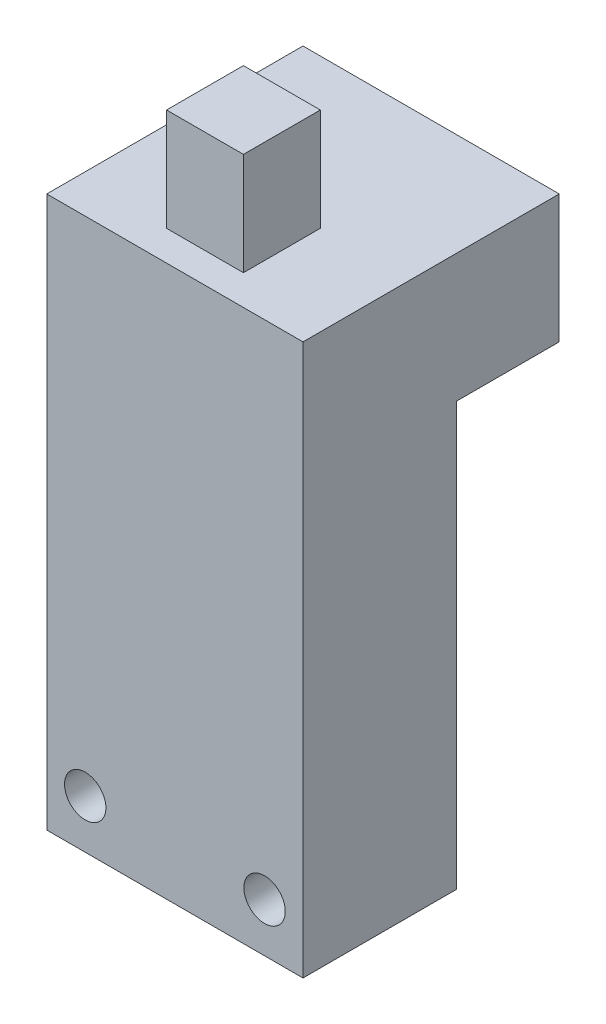
ISO-10303-21;
HEADER;
FILE_DESCRIPTION(('STEP AP214'),'2;1');
FILE_NAME('part.step','',(''),(''),'','','');
FILE_SCHEMA(('AUTOMOTIVE_DESIGN { 1 0 10303 214 1 1 1 1 }'));
ENDSEC;
DATA;
#1=APPLICATION_CONTEXT('core data for automotive mechanical design processes');
#2=APPLICATION_PROTOCOL_DEFINITION('international standard','automotive_design',2000,#1);
#3=PRODUCT_CONTEXT('',#1,'mechanical');
#4=PRODUCT('Part','Part','',(#3));
#5=PRODUCT_RELATED_PRODUCT_CATEGORY('part','',(#4));
#6=PRODUCT_DEFINITION_FORMATION('','',#4);
#7=PRODUCT_DEFINITION_CONTEXT('part definition',#1,'design');
#8=PRODUCT_DEFINITION('design','',#6,#7);
#9=PRODUCT_DEFINITION_SHAPE('','',#8);
#10=(LENGTH_UNIT() NAMED_UNIT(*) SI_UNIT(.MILLI.,.METRE.));
#11=(NAMED_UNIT(*) PLANE_ANGLE_UNIT() SI_UNIT($,.RADIAN.));
#12=(NAMED_UNIT(*) SI_UNIT($,.STERADIAN.) SOLID_ANGLE_UNIT());
#13=UNCERTAINTY_MEASURE_WITH_UNIT(LENGTH_MEASURE(1.E-05),#10,'distance_accuracy_value','');
#14=(GEOMETRIC_REPRESENTATION_CONTEXT(3) GLOBAL_UNCERTAINTY_ASSIGNED_CONTEXT((#13)) GLOBAL_UNIT_ASSIGNED_CONTEXT((#10,
#11,#12)) REPRESENTATION_CONTEXT('',''));
#15=CARTESIAN_POINT('',(0.,0.,0.));
#16=DIRECTION('',(0.,0.,1.));
#17=DIRECTION('',(1.,0.,0.));
#18=AXIS2_PLACEMENT_3D('',#15,#16,#17);
#19=CARTESIAN_POINT('',(0.,10.,0.));
#20=DIRECTION('',(0.,-1.,0.));
#21=DIRECTION('',(0.,0.,-1.));
#22=AXIS2_PLACEMENT_3D('',#19,#20,#21);
#23=PLANE('',#22);
#24=DIRECTION('',(0.,0.,1.));
#25=VECTOR('',#24,1.);
#26=CARTESIAN_POINT('',(0.,10.,0.));
#27=LINE('',#26,#25);
#28=CARTESIAN_POINT('',(0.,10.,-20.));
#29=VERTEX_POINT('',#28);
#30=CARTESIAN_POINT('',(0.,10.,0.));
#31=VERTEX_POINT('',#30);
#32=EDGE_CURVE('E169',#29,#31,#27,.T.);
#33=ORIENTED_EDGE('',*,*,#32,.T.);
#34=DIRECTION('',(1.,0.,0.));
#35=VECTOR('',#34,1.);
#36=CARTESIAN_POINT('',(0.,10.,0.));
#37=LINE('',#36,#35);
#38=CARTESIAN_POINT('',(20.,10.,0.));
#39=VERTEX_POINT('',#38);
#40=EDGE_CURVE('E172',#31,#39,#37,.T.);
#41=ORIENTED_EDGE('',*,*,#40,.T.);
#42=DIRECTION('',(0.,0.,-1.));
#43=VECTOR('',#42,1.);
#44=CARTESIAN_POINT('',(20.,10.,0.));
#45=LINE('',#44,#43);
#46=CARTESIAN_POINT('',(20.,10.,-20.));
#47=VERTEX_POINT('',#46);
#48=EDGE_CURVE('E175',#39,#47,#45,.T.);
#49=ORIENTED_EDGE('',*,*,#48,.T.);
#50=DIRECTION('',(-1.,0.,0.));
#51=VECTOR('',#50,1.);
#52=CARTESIAN_POINT('',(0.,10.,-20.));
#53=LINE('',#52,#51);
#54=EDGE_CURVE('E177',#47,#29,#53,.T.);
#55=ORIENTED_EDGE('',*,*,#54,.T.);
#56=EDGE_LOOP('',(#33,#41,#49,#55));
#57=FACE_BOUND('',#56,.T.);
#58=DIRECTION('',(0.,0.,1.));
#59=VECTOR('',#58,1.);
#60=CARTESIAN_POINT('',(7.,10.,-8.35));
#61=LINE('',#60,#59);
#62=CARTESIAN_POINT('',(7.,10.,-8.35));
#63=VERTEX_POINT('',#62);
#64=CARTESIAN_POINT('',(7.,10.,-2.35));
#65=VERTEX_POINT('',#64);
#66=EDGE_CURVE('E135',#63,#65,#61,.T.);
#67=ORIENTED_EDGE('',*,*,#66,.F.);
#68=DIRECTION('',(-1.,0.,0.));
#69=VECTOR('',#68,1.);
#70=CARTESIAN_POINT('',(7.,10.,-8.35));
#71=LINE('',#70,#69);
#72=CARTESIAN_POINT('',(13.,10.,-8.35));
#73=VERTEX_POINT('',#72);
#74=EDGE_CURVE('E146',#73,#63,#71,.T.);
#75=ORIENTED_EDGE('',*,*,#74,.F.);
#76=DIRECTION('',(0.,0.,-1.));
#77=VECTOR('',#76,1.);
#78=CARTESIAN_POINT('',(13.,10.,-8.35));
#79=LINE('',#78,#77);
#80=CARTESIAN_POINT('',(13.,10.,-2.35));
#81=VERTEX_POINT('',#80);
#82=EDGE_CURVE('E154',#81,#73,#79,.T.);
#83=ORIENTED_EDGE('',*,*,#82,.F.);
#84=DIRECTION('',(1.,0.,0.));
#85=VECTOR('',#84,1.);
#86=CARTESIAN_POINT('',(7.,10.,-2.35));
#87=LINE('',#86,#85);
#88=EDGE_CURVE('E58',#65,#81,#87,.T.);
#89=ORIENTED_EDGE('',*,*,#88,.F.);
#90=EDGE_LOOP('',(#67,#75,#83,#89));
#91=FACE_BOUND('',#90,.T.);
#92=ADVANCED_FACE('F33',(#57,#91),#23,.F.);
#93=CARTESIAN_POINT('',(0.,10.,0.));
#94=DIRECTION('',(1.,0.,0.));
#95=DIRECTION('',(0.,0.,-1.));
#96=AXIS2_PLACEMENT_3D('',#93,#94,#95);
#97=PLANE('',#96);
#98=DIRECTION('',(0.,0.,1.));
#99=VECTOR('',#98,1.);
#100=CARTESIAN_POINT('',(0.,0.,0.));
#101=LINE('',#100,#99);
#102=CARTESIAN_POINT('',(0.,0.,-20.));
#103=VERTEX_POINT('',#102);
#104=CARTESIAN_POINT('',(0.,0.,-12.));
#105=VERTEX_POINT('',#104);
#106=EDGE_CURVE('E134',#103,#105,#101,.T.);
#107=ORIENTED_EDGE('',*,*,#106,.T.);
#108=DIRECTION('',(0.,1.,0.));
#109=VECTOR('',#108,1.);
#110=CARTESIAN_POINT('',(0.,-33.,-12.));
#111=LINE('',#110,#109);
#112=CARTESIAN_POINT('',(0.,-33.,-12.));
#113=VERTEX_POINT('',#112);
#114=EDGE_CURVE('E116',#113,#105,#111,.T.);
#115=ORIENTED_EDGE('',*,*,#114,.F.);
#116=DIRECTION('',(0.,0.,-1.));
#117=VECTOR('',#116,1.);
#118=CARTESIAN_POINT('',(0.,-33.,0.));
#119=LINE('',#118,#117);
#120=CARTESIAN_POINT('',(0.,-33.,0.));
#121=VERTEX_POINT('',#120);
#122=EDGE_CURVE('E123',#121,#113,#119,.T.);
#123=ORIENTED_EDGE('',*,*,#122,.F.);
#124=DIRECTION('',(0.,-1.,0.));
#125=VECTOR('',#124,1.);
#126=CARTESIAN_POINT('',(0.,10.,0.));
#127=LINE('',#126,#125);
#128=EDGE_CURVE('E11',#31,#121,#127,.T.);
#129=ORIENTED_EDGE('',*,*,#128,.F.);
#130=ORIENTED_EDGE('',*,*,#32,.F.);
#131=DIRECTION('',(0.,-1.,0.));
#132=VECTOR('',#131,1.);
#133=CARTESIAN_POINT('',(0.,10.,-20.));
#134=LINE('',#133,#132);
#135=EDGE_CURVE('E179',#29,#103,#134,.T.);
#136=ORIENTED_EDGE('',*,*,#135,.T.);
#137=EDGE_LOOP('',(#107,#115,#123,#129,#130,#136));
#138=FACE_BOUND('',#137,.T.);
#139=ADVANCED_FACE('F35',(#138),#97,.F.);
#140=CARTESIAN_POINT('',(0.,10.,0.));
#141=DIRECTION('',(0.,0.,-1.));
#142=DIRECTION('',(-1.,0.,0.));
#143=AXIS2_PLACEMENT_3D('',#140,#141,#142);
#144=PLANE('',#143);
#145=CARTESIAN_POINT('',(17.,-29.2,0.));
#146=DIRECTION('',(0.,0.,1.));
#147=DIRECTION('',(1.,0.,0.));
#148=AXIS2_PLACEMENT_3D('',#145,#146,#147);
#149=CIRCLE('',#148,1.615);
#150=CARTESIAN_POINT('',(18.615,-29.2,0.));
#151=VERTEX_POINT('',#150);
#152=EDGE_CURVE('E190',#151,#151,#149,.T.);
#153=ORIENTED_EDGE('',*,*,#152,.F.);
#154=EDGE_LOOP('',(#153));
#155=FACE_BOUND('',#154,.T.);
#156=CARTESIAN_POINT('',(3.,-29.2,0.));
#157=DIRECTION('',(0.,0.,1.));
#158=DIRECTION('',(1.,0.,0.));
#159=AXIS2_PLACEMENT_3D('',#156,#157,#158);
#160=CIRCLE('',#159,1.615);
#161=CARTESIAN_POINT('',(4.615,-29.2,0.));
#162=VERTEX_POINT('',#161);
#163=EDGE_CURVE('E195',#162,#162,#160,.T.);
#164=ORIENTED_EDGE('',*,*,#163,.F.);
#165=EDGE_LOOP('',(#164));
#166=FACE_BOUND('',#165,.T.);
#167=ORIENTED_EDGE('',*,*,#128,.T.);
#168=DIRECTION('',(-1.,0.,0.));
#169=VECTOR('',#168,1.);
#170=CARTESIAN_POINT('',(0.,-33.,0.));
#171=LINE('',#170,#169);
#172=CARTESIAN_POINT('',(20.,-33.,0.));
#173=VERTEX_POINT('',#172);
#174=EDGE_CURVE('E129',#173,#121,#171,.T.);
#175=ORIENTED_EDGE('',*,*,#174,.F.);
#176=DIRECTION('',(0.,-1.,0.));
#177=VECTOR('',#176,1.);
#178=CARTESIAN_POINT('',(20.,10.,0.));
#179=LINE('',#178,#177);
#180=EDGE_CURVE('E42',#39,#173,#179,.T.);
#181=ORIENTED_EDGE('',*,*,#180,.F.);
#182=ORIENTED_EDGE('',*,*,#40,.F.);
#183=EDGE_LOOP('',(#167,#175,#181,#182));
#184=FACE_BOUND('',#183,.T.);
#185=ADVANCED_FACE('F209',(#155,#166,#184),#144,.F.);
#186=CARTESIAN_POINT('',(20.,10.,0.));
#187=DIRECTION('',(-1.,0.,0.));
#188=DIRECTION('',(0.,0.,1.));
#189=AXIS2_PLACEMENT_3D('',#186,#187,#188);
#190=PLANE('',#189);
#191=ORIENTED_EDGE('',*,*,#180,.T.);
#192=DIRECTION('',(0.,0.,1.));
#193=VECTOR('',#192,1.);
#194=CARTESIAN_POINT('',(20.,-33.,0.));
#195=LINE('',#194,#193);
#196=CARTESIAN_POINT('',(20.,-33.,-12.));
#197=VERTEX_POINT('',#196);
#198=EDGE_CURVE('E122',#197,#173,#195,.T.);
#199=ORIENTED_EDGE('',*,*,#198,.F.);
#200=DIRECTION('',(0.,1.,0.));
#201=VECTOR('',#200,1.);
#202=CARTESIAN_POINT('',(20.,-33.,-12.));
#203=LINE('',#202,#201);
#204=CARTESIAN_POINT('',(20.,0.,-12.));
#205=VERTEX_POINT('',#204);
#206=EDGE_CURVE('E118',#197,#205,#203,.T.);
#207=ORIENTED_EDGE('',*,*,#206,.T.);
#208=DIRECTION('',(0.,0.,-1.));
#209=VECTOR('',#208,1.);
#210=CARTESIAN_POINT('',(20.,0.,0.));
#211=LINE('',#210,#209);
#212=CARTESIAN_POINT('',(20.,0.,-20.));
#213=VERTEX_POINT('',#212);
#214=EDGE_CURVE('E181',#205,#213,#211,.T.);
#215=ORIENTED_EDGE('',*,*,#214,.T.);
#216=DIRECTION('',(0.,-1.,0.));
#217=VECTOR('',#216,1.);
#218=CARTESIAN_POINT('',(20.,10.,-20.));
#219=LINE('',#218,#217);
#220=EDGE_CURVE('E185',#47,#213,#219,.T.);
#221=ORIENTED_EDGE('',*,*,#220,.F.);
#222=ORIENTED_EDGE('',*,*,#48,.F.);
#223=EDGE_LOOP('',(#191,#199,#207,#215,#221,#222));
#224=FACE_BOUND('',#223,.T.);
#225=ADVANCED_FACE('F204',(#224),#190,.F.);
#226=CARTESIAN_POINT('',(0.,10.,-20.));
#227=DIRECTION('',(0.,0.,1.));
#228=DIRECTION('',(1.,0.,0.));
#229=AXIS2_PLACEMENT_3D('',#226,#227,#228);
#230=PLANE('',#229);
#231=DIRECTION('',(-1.,0.,0.));
#232=VECTOR('',#231,1.);
#233=CARTESIAN_POINT('',(0.,0.,-20.));
#234=LINE('',#233,#232);
#235=EDGE_CURVE('E173',#213,#103,#234,.T.);
#236=ORIENTED_EDGE('',*,*,#235,.T.);
#237=ORIENTED_EDGE('',*,*,#135,.F.);
#238=ORIENTED_EDGE('',*,*,#54,.F.);
#239=ORIENTED_EDGE('',*,*,#220,.T.);
#240=EDGE_LOOP('',(#236,#237,#238,#239));
#241=FACE_BOUND('',#240,.T.);
#242=ADVANCED_FACE('F215',(#241),#230,.F.);
#243=CARTESIAN_POINT('',(0.,0.,0.));
#244=DIRECTION('',(0.,-1.,0.));
#245=DIRECTION('',(0.,0.,-1.));
#246=AXIS2_PLACEMENT_3D('',#243,#244,#245);
#247=PLANE('',#246);
#248=DIRECTION('',(1.,0.,0.));
#249=VECTOR('',#248,1.);
#250=CARTESIAN_POINT('',(0.,0.,-12.));
#251=LINE('',#250,#249);
#252=EDGE_CURVE('E50',#105,#205,#251,.T.);
#253=ORIENTED_EDGE('',*,*,#252,.F.);
#254=ORIENTED_EDGE('',*,*,#106,.F.);
#255=ORIENTED_EDGE('',*,*,#235,.F.);
#256=ORIENTED_EDGE('',*,*,#214,.F.);
#257=EDGE_LOOP('',(#253,#254,#255,#256));
#258=FACE_BOUND('',#257,.T.);
#259=ADVANCED_FACE('F217',(#258),#247,.T.);
#260=CARTESIAN_POINT('',(7.,18.,-8.35));
#261=DIRECTION('',(1.,0.,0.));
#262=DIRECTION('',(0.,0.,-1.));
#263=AXIS2_PLACEMENT_3D('',#260,#261,#262);
#264=PLANE('',#263);
#265=ORIENTED_EDGE('',*,*,#66,.T.);
#266=DIRECTION('',(0.,-1.,0.));
#267=VECTOR('',#266,1.);
#268=CARTESIAN_POINT('',(7.,18.,-2.35));
#269=LINE('',#268,#267);
#270=CARTESIAN_POINT('',(7.,18.,-2.35));
#271=VERTEX_POINT('',#270);
#272=EDGE_CURVE('E167',#271,#65,#269,.T.);
#273=ORIENTED_EDGE('',*,*,#272,.F.);
#274=DIRECTION('',(0.,0.,1.));
#275=VECTOR('',#274,1.);
#276=CARTESIAN_POINT('',(7.,18.,-8.35));
#277=LINE('',#276,#275);
#278=CARTESIAN_POINT('',(7.,18.,-8.35));
#279=VERTEX_POINT('',#278);
#280=EDGE_CURVE('E142',#279,#271,#277,.T.);
#281=ORIENTED_EDGE('',*,*,#280,.F.);
#282=DIRECTION('',(0.,-1.,0.));
#283=VECTOR('',#282,1.);
#284=CARTESIAN_POINT('',(7.,18.,-8.35));
#285=LINE('',#284,#283);
#286=EDGE_CURVE('E151',#279,#63,#285,.T.);
#287=ORIENTED_EDGE('',*,*,#286,.T.);
#288=EDGE_LOOP('',(#265,#273,#281,#287));
#289=FACE_BOUND('',#288,.T.);
#290=ADVANCED_FACE('F219',(#289),#264,.F.);
#291=CARTESIAN_POINT('',(7.,18.,-2.35));
#292=DIRECTION('',(0.,0.,-1.));
#293=DIRECTION('',(-1.,0.,0.));
#294=AXIS2_PLACEMENT_3D('',#291,#292,#293);
#295=PLANE('',#294);
#296=ORIENTED_EDGE('',*,*,#88,.T.);
#297=DIRECTION('',(0.,-1.,0.));
#298=VECTOR('',#297,1.);
#299=CARTESIAN_POINT('',(13.,18.,-2.35));
#300=LINE('',#299,#298);
#301=CARTESIAN_POINT('',(13.,18.,-2.35));
#302=VERTEX_POINT('',#301);
#303=EDGE_CURVE('E164',#302,#81,#300,.T.);
#304=ORIENTED_EDGE('',*,*,#303,.F.);
#305=DIRECTION('',(1.,0.,0.));
#306=VECTOR('',#305,1.);
#307=CARTESIAN_POINT('',(7.,18.,-2.35));
#308=LINE('',#307,#306);
#309=EDGE_CURVE('E145',#271,#302,#308,.T.);
#310=ORIENTED_EDGE('',*,*,#309,.F.);
#311=ORIENTED_EDGE('',*,*,#272,.T.);
#312=EDGE_LOOP('',(#296,#304,#310,#311));
#313=FACE_BOUND('',#312,.T.);
#314=ADVANCED_FACE('F225',(#313),#295,.F.);
#315=CARTESIAN_POINT('',(13.,18.,-8.35));
#316=DIRECTION('',(-1.,0.,0.));
#317=DIRECTION('',(0.,0.,1.));
#318=AXIS2_PLACEMENT_3D('',#315,#316,#317);
#319=PLANE('',#318);
#320=ORIENTED_EDGE('',*,*,#82,.T.);
#321=DIRECTION('',(0.,-1.,0.));
#322=VECTOR('',#321,1.);
#323=CARTESIAN_POINT('',(13.,18.,-8.35));
#324=LINE('',#323,#322);
#325=CARTESIAN_POINT('',(13.,18.,-8.35));
#326=VERTEX_POINT('',#325);
#327=EDGE_CURVE('E161',#326,#73,#324,.T.);
#328=ORIENTED_EDGE('',*,*,#327,.F.);
#329=DIRECTION('',(0.,0.,-1.));
#330=VECTOR('',#329,1.);
#331=CARTESIAN_POINT('',(13.,18.,-8.35));
#332=LINE('',#331,#330);
#333=EDGE_CURVE('E148',#302,#326,#332,.T.);
#334=ORIENTED_EDGE('',*,*,#333,.F.);
#335=ORIENTED_EDGE('',*,*,#303,.T.);
#336=EDGE_LOOP('',(#320,#328,#334,#335));
#337=FACE_BOUND('',#336,.T.);
#338=ADVANCED_FACE('F237',(#337),#319,.F.);
#339=CARTESIAN_POINT('',(7.,18.,-8.35));
#340=DIRECTION('',(0.,0.,1.));
#341=DIRECTION('',(1.,0.,0.));
#342=AXIS2_PLACEMENT_3D('',#339,#340,#341);
#343=PLANE('',#342);
#344=ORIENTED_EDGE('',*,*,#74,.T.);
#345=ORIENTED_EDGE('',*,*,#286,.F.);
#346=DIRECTION('',(-1.,0.,0.));
#347=VECTOR('',#346,1.);
#348=CARTESIAN_POINT('',(7.,18.,-8.35));
#349=LINE('',#348,#347);
#350=EDGE_CURVE('E150',#326,#279,#349,.T.);
#351=ORIENTED_EDGE('',*,*,#350,.F.);
#352=ORIENTED_EDGE('',*,*,#327,.T.);
#353=EDGE_LOOP('',(#344,#345,#351,#352));
#354=FACE_BOUND('',#353,.T.);
#355=ADVANCED_FACE('F241',(#354),#343,.F.);
#356=CARTESIAN_POINT('',(0.,18.,0.));
#357=DIRECTION('',(0.,1.,0.));
#358=DIRECTION('',(0.,0.,1.));
#359=AXIS2_PLACEMENT_3D('',#356,#357,#358);
#360=PLANE('',#359);
#361=ORIENTED_EDGE('',*,*,#280,.T.);
#362=ORIENTED_EDGE('',*,*,#309,.T.);
#363=ORIENTED_EDGE('',*,*,#333,.T.);
#364=ORIENTED_EDGE('',*,*,#350,.T.);
#365=EDGE_LOOP('',(#361,#362,#363,#364));
#366=FACE_BOUND('',#365,.T.);
#367=ADVANCED_FACE('F245',(#366),#360,.T.);
#368=CARTESIAN_POINT('',(0.,-33.,-12.));
#369=DIRECTION('',(0.,0.,1.));
#370=DIRECTION('',(1.,0.,0.));
#371=AXIS2_PLACEMENT_3D('',#368,#369,#370);
#372=PLANE('',#371);
#373=CARTESIAN_POINT('',(17.,-29.2,-12.));
#374=DIRECTION('',(0.,0.,1.));
#375=DIRECTION('',(1.,0.,0.));
#376=AXIS2_PLACEMENT_3D('',#373,#374,#375);
#377=CIRCLE('',#376,1.615);
#378=CARTESIAN_POINT('',(18.615,-29.2,-12.));
#379=VERTEX_POINT('',#378);
#380=EDGE_CURVE('E37',#379,#379,#377,.T.);
#381=ORIENTED_EDGE('',*,*,#380,.T.);
#382=EDGE_LOOP('',(#381));
#383=FACE_BOUND('',#382,.T.);
#384=CARTESIAN_POINT('',(3.,-29.2,-12.));
#385=DIRECTION('',(0.,0.,1.));
#386=DIRECTION('',(1.,0.,0.));
#387=AXIS2_PLACEMENT_3D('',#384,#385,#386);
#388=CIRCLE('',#387,1.615);
#389=CARTESIAN_POINT('',(4.615,-29.2,-12.));
#390=VERTEX_POINT('',#389);
#391=EDGE_CURVE('E188',#390,#390,#388,.T.);
#392=ORIENTED_EDGE('',*,*,#391,.T.);
#393=EDGE_LOOP('',(#392));
#394=FACE_BOUND('',#393,.T.);
#395=ORIENTED_EDGE('',*,*,#252,.T.);
#396=ORIENTED_EDGE('',*,*,#206,.F.);
#397=DIRECTION('',(1.,0.,0.));
#398=VECTOR('',#397,1.);
#399=CARTESIAN_POINT('',(0.,-33.,-12.));
#400=LINE('',#399,#398);
#401=EDGE_CURVE('E112',#113,#197,#400,.T.);
#402=ORIENTED_EDGE('',*,*,#401,.F.);
#403=ORIENTED_EDGE('',*,*,#114,.T.);
#404=EDGE_LOOP('',(#395,#396,#402,#403));
#405=FACE_BOUND('',#404,.T.);
#406=ADVANCED_FACE('F114',(#383,#394,#405),#372,.F.);
#407=CARTESIAN_POINT('',(0.,-33.,0.));
#408=DIRECTION('',(0.,-1.,0.));
#409=DIRECTION('',(0.,0.,-1.));
#410=AXIS2_PLACEMENT_3D('',#407,#408,#409);
#411=PLANE('',#410);
#412=ORIENTED_EDGE('',*,*,#122,.T.);
#413=ORIENTED_EDGE('',*,*,#401,.T.);
#414=ORIENTED_EDGE('',*,*,#198,.T.);
#415=ORIENTED_EDGE('',*,*,#174,.T.);
#416=EDGE_LOOP('',(#412,#413,#414,#415));
#417=FACE_BOUND('',#416,.T.);
#418=ADVANCED_FACE('F127',(#417),#411,.T.);
#419=CARTESIAN_POINT('',(3.,-29.2,-20.));
#420=DIRECTION('',(0.,0.,1.));
#421=DIRECTION('',(1.,0.,0.));
#422=AXIS2_PLACEMENT_3D('',#419,#420,#421);
#423=CYLINDRICAL_SURFACE('',#422,1.615);
#424=ORIENTED_EDGE('',*,*,#163,.T.);
#425=EDGE_LOOP('',(#424));
#426=FACE_BOUND('',#425,.T.);
#427=ORIENTED_EDGE('',*,*,#391,.F.);
#428=EDGE_LOOP('',(#427));
#429=FACE_BOUND('',#428,.T.);
#430=ADVANCED_FACE('F255',(#426,#429),#423,.F.);
#431=CARTESIAN_POINT('',(17.,-29.2,-20.));
#432=DIRECTION('',(0.,0.,1.));
#433=DIRECTION('',(1.,0.,0.));
#434=AXIS2_PLACEMENT_3D('',#431,#432,#433);
#435=CYLINDRICAL_SURFACE('',#434,1.615);
#436=ORIENTED_EDGE('',*,*,#152,.T.);
#437=EDGE_LOOP('',(#436));
#438=FACE_BOUND('',#437,.T.);
#439=ORIENTED_EDGE('',*,*,#380,.F.);
#440=EDGE_LOOP('',(#439));
#441=FACE_BOUND('',#440,.T.);
#442=ADVANCED_FACE('F258',(#438,#441),#435,.F.);
#443=CLOSED_SHELL('',(#92,#139,#185,#225,#242,#259,#290,#314,#338,#355,#367,#406,#418,#430,#442));
#444=MANIFOLD_SOLID_BREP('B2',#443);
#445=ADVANCED_BREP_SHAPE_REPRESENTATION('',(#18,#444),#14);
#446=SHAPE_DEFINITION_REPRESENTATION(#9,#445);
ENDSEC;
END-ISO-10303-21;
